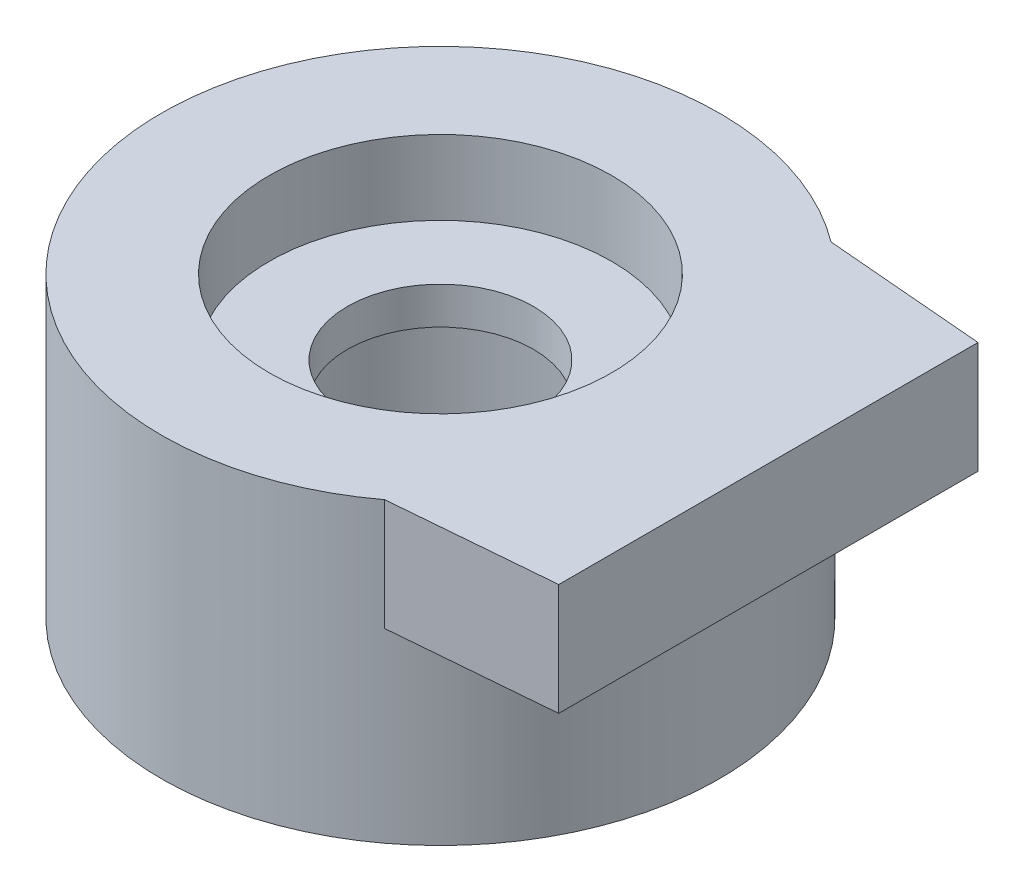
ISO-10303-21;
HEADER;
FILE_DESCRIPTION(('STEP AP214'),'2;1');
FILE_NAME('part.step','',(''),(''),'','','');
FILE_SCHEMA(('AUTOMOTIVE_DESIGN { 1 0 10303 214 1 1 1 1 }'));
ENDSEC;
DATA;
#1=APPLICATION_CONTEXT('core data for automotive mechanical design processes');
#2=APPLICATION_PROTOCOL_DEFINITION('international standard','automotive_design',2000,#1);
#3=PRODUCT_CONTEXT('',#1,'mechanical');
#4=PRODUCT('Part','Part','',(#3));
#5=PRODUCT_RELATED_PRODUCT_CATEGORY('part','',(#4));
#6=PRODUCT_DEFINITION_FORMATION('','',#4);
#7=PRODUCT_DEFINITION_CONTEXT('part definition',#1,'design');
#8=PRODUCT_DEFINITION('design','',#6,#7);
#9=PRODUCT_DEFINITION_SHAPE('','',#8);
#10=(LENGTH_UNIT() NAMED_UNIT(*) SI_UNIT(.MILLI.,.METRE.));
#11=(NAMED_UNIT(*) PLANE_ANGLE_UNIT() SI_UNIT($,.RADIAN.));
#12=(NAMED_UNIT(*) SI_UNIT($,.STERADIAN.) SOLID_ANGLE_UNIT());
#13=UNCERTAINTY_MEASURE_WITH_UNIT(LENGTH_MEASURE(1.E-05),#10,'distance_accuracy_value','');
#14=(GEOMETRIC_REPRESENTATION_CONTEXT(3) GLOBAL_UNCERTAINTY_ASSIGNED_CONTEXT((#13)) GLOBAL_UNIT_ASSIGNED_CONTEXT((#10,
#11,#12)) REPRESENTATION_CONTEXT('',''));
#15=CARTESIAN_POINT('',(0.,0.,0.));
#16=DIRECTION('',(0.,0.,1.));
#17=DIRECTION('',(1.,0.,0.));
#18=AXIS2_PLACEMENT_3D('',#15,#16,#17);
#19=CARTESIAN_POINT('',(0.,2.5,0.));
#20=DIRECTION('',(0.,1.,0.));
#21=DIRECTION('',(0.,0.,1.));
#22=AXIS2_PLACEMENT_3D('',#19,#20,#21);
#23=PLANE('',#22);
#24=CARTESIAN_POINT('',(0.,2.5,0.));
#25=DIRECTION('',(0.,-1.,0.));
#26=DIRECTION('',(0.,0.,-1.));
#27=AXIS2_PLACEMENT_3D('',#24,#25,#26);
#28=CIRCLE('',#27,3.75);
#29=CARTESIAN_POINT('',(2.25,2.5,-3.));
#30=VERTEX_POINT('',#29);
#31=CARTESIAN_POINT('',(2.25,2.5,3.));
#32=VERTEX_POINT('',#31);
#33=EDGE_CURVE('E73',#30,#32,#28,.T.);
#34=ORIENTED_EDGE('',*,*,#33,.F.);
#35=DIRECTION('',(-0.996448898518601,0.,-0.0841997187707064));
#36=VECTOR('',#35,1.);
#37=CARTESIAN_POINT('',(4.40776789419964,2.5,-2.81766907451634));
#38=LINE('',#37,#36);
#39=CARTESIAN_POINT('',(4.40776789419964,2.5,-2.81766907451634));
#40=VERTEX_POINT('',#39);
#41=EDGE_CURVE('E80',#40,#30,#38,.T.);
#42=ORIENTED_EDGE('',*,*,#41,.F.);
#43=DIRECTION('',(0.,0.,-1.));
#44=VECTOR('',#43,1.);
#45=CARTESIAN_POINT('',(4.40776789419964,2.5,2.81766907451634));
#46=LINE('',#45,#44);
#47=CARTESIAN_POINT('',(4.40776789419964,2.5,2.81766907451634));
#48=VERTEX_POINT('',#47);
#49=EDGE_CURVE('E91',#48,#40,#46,.T.);
#50=ORIENTED_EDGE('',*,*,#49,.F.);
#51=DIRECTION('',(0.996448898518601,0.,-0.0841997187707066));
#52=VECTOR('',#51,1.);
#53=CARTESIAN_POINT('',(2.25,2.5,3.));
#54=LINE('',#53,#52);
#55=EDGE_CURVE('E82',#32,#48,#54,.T.);
#56=ORIENTED_EDGE('',*,*,#55,.F.);
#57=EDGE_LOOP('',(#34,#42,#50,#56));
#58=FACE_BOUND('',#57,.T.);
#59=ADVANCED_FACE('F33',(#58),#23,.F.);
#60=CARTESIAN_POINT('',(0.,2.5,0.));
#61=DIRECTION('',(0.,1.,0.));
#62=DIRECTION('',(0.,0.,1.));
#63=AXIS2_PLACEMENT_3D('',#60,#61,#62);
#64=CYLINDRICAL_SURFACE('',#63,3.75);
#65=CARTESIAN_POINT('',(0.,4.,0.));
#66=DIRECTION('',(0.,1.,0.));
#67=DIRECTION('',(0.,0.,1.));
#68=AXIS2_PLACEMENT_3D('',#65,#66,#67);
#69=CIRCLE('',#68,3.75);
#70=CARTESIAN_POINT('',(2.25,4.,-3.));
#71=VERTEX_POINT('',#70);
#72=CARTESIAN_POINT('',(2.25,4.,3.));
#73=VERTEX_POINT('',#72);
#74=EDGE_CURVE('E88',#71,#73,#69,.T.);
#75=ORIENTED_EDGE('',*,*,#74,.F.);
#76=DIRECTION('',(0.,1.,0.));
#77=VECTOR('',#76,1.);
#78=CARTESIAN_POINT('',(2.25,2.5,-3.));
#79=LINE('',#78,#77);
#80=EDGE_CURVE('E11',#30,#71,#79,.T.);
#81=ORIENTED_EDGE('',*,*,#80,.F.);
#82=ORIENTED_EDGE('',*,*,#33,.T.);
#83=DIRECTION('',(0.,1.,0.));
#84=VECTOR('',#83,1.);
#85=CARTESIAN_POINT('',(2.25,2.5,3.));
#86=LINE('',#85,#84);
#87=EDGE_CURVE('E37',#32,#73,#86,.T.);
#88=ORIENTED_EDGE('',*,*,#87,.T.);
#89=EDGE_LOOP('',(#75,#81,#82,#88));
#90=FACE_BOUND('',#89,.T.);
#91=CARTESIAN_POINT('',(0.,0.,0.));
#92=DIRECTION('',(0.,-1.,0.));
#93=DIRECTION('',(0.,0.,-1.));
#94=AXIS2_PLACEMENT_3D('',#91,#92,#93);
#95=CIRCLE('',#94,3.75);
#96=CARTESIAN_POINT('',(0.,0.,-3.75));
#97=VERTEX_POINT('',#96);
#98=EDGE_CURVE('E83',#97,#97,#95,.T.);
#99=ORIENTED_EDGE('',*,*,#98,.F.);
#100=EDGE_LOOP('',(#99));
#101=FACE_BOUND('',#100,.T.);
#102=ADVANCED_FACE('F35',(#90,#101),#64,.T.);
#103=CARTESIAN_POINT('',(4.40776789419964,2.5,-2.81766907451634));
#104=DIRECTION('',(0.0841997187707064,0.,-0.996448898518601));
#105=DIRECTION('',(-0.996448898518601,0.,-0.0841997187707064));
#106=AXIS2_PLACEMENT_3D('',#103,#104,#105);
#107=PLANE('',#106);
#108=DIRECTION('',(-0.996448898518601,0.,-0.0841997187707064));
#109=VECTOR('',#108,1.);
#110=CARTESIAN_POINT('',(4.40776789419964,4.,-2.81766907451634));
#111=LINE('',#110,#109);
#112=CARTESIAN_POINT('',(4.40776789419964,4.,-2.81766907451634));
#113=VERTEX_POINT('',#112);
#114=EDGE_CURVE('E103',#113,#71,#111,.T.);
#115=ORIENTED_EDGE('',*,*,#114,.F.);
#116=DIRECTION('',(0.,1.,0.));
#117=VECTOR('',#116,1.);
#118=CARTESIAN_POINT('',(4.40776789419964,2.5,-2.81766907451634));
#119=LINE('',#118,#117);
#120=EDGE_CURVE('E43',#40,#113,#119,.T.);
#121=ORIENTED_EDGE('',*,*,#120,.F.);
#122=ORIENTED_EDGE('',*,*,#41,.T.);
#123=ORIENTED_EDGE('',*,*,#80,.T.);
#124=EDGE_LOOP('',(#115,#121,#122,#123));
#125=FACE_BOUND('',#124,.T.);
#126=ADVANCED_FACE('F90',(#125),#107,.T.);
#127=CARTESIAN_POINT('',(4.40776789419964,2.5,2.81766907451634));
#128=DIRECTION('',(1.,0.,0.));
#129=DIRECTION('',(0.,0.,-1.));
#130=AXIS2_PLACEMENT_3D('',#127,#128,#129);
#131=PLANE('',#130);
#132=DIRECTION('',(0.,0.,-1.));
#133=VECTOR('',#132,1.);
#134=CARTESIAN_POINT('',(4.40776789419964,4.,2.81766907451634));
#135=LINE('',#134,#133);
#136=CARTESIAN_POINT('',(4.40776789419964,4.,2.81766907451634));
#137=VERTEX_POINT('',#136);
#138=EDGE_CURVE('E101',#137,#113,#135,.T.);
#139=ORIENTED_EDGE('',*,*,#138,.F.);
#140=DIRECTION('',(0.,1.,0.));
#141=VECTOR('',#140,1.);
#142=CARTESIAN_POINT('',(4.40776789419964,2.5,2.81766907451634));
#143=LINE('',#142,#141);
#144=EDGE_CURVE('E93',#48,#137,#143,.T.);
#145=ORIENTED_EDGE('',*,*,#144,.F.);
#146=ORIENTED_EDGE('',*,*,#49,.T.);
#147=ORIENTED_EDGE('',*,*,#120,.T.);
#148=EDGE_LOOP('',(#139,#145,#146,#147));
#149=FACE_BOUND('',#148,.T.);
#150=ADVANCED_FACE('F108',(#149),#131,.T.);
#151=CARTESIAN_POINT('',(2.25,2.5,3.));
#152=DIRECTION('',(0.0841997187707066,0.,0.996448898518601));
#153=DIRECTION('',(0.996448898518601,0.,-0.0841997187707066));
#154=AXIS2_PLACEMENT_3D('',#151,#152,#153);
#155=PLANE('',#154);
#156=DIRECTION('',(0.996448898518601,0.,-0.0841997187707066));
#157=VECTOR('',#156,1.);
#158=CARTESIAN_POINT('',(2.25,4.,3.));
#159=LINE('',#158,#157);
#160=EDGE_CURVE('E98',#73,#137,#159,.T.);
#161=ORIENTED_EDGE('',*,*,#160,.F.);
#162=ORIENTED_EDGE('',*,*,#87,.F.);
#163=ORIENTED_EDGE('',*,*,#55,.T.);
#164=ORIENTED_EDGE('',*,*,#144,.T.);
#165=EDGE_LOOP('',(#161,#162,#163,#164));
#166=FACE_BOUND('',#165,.T.);
#167=ADVANCED_FACE('F107',(#166),#155,.T.);
#168=CARTESIAN_POINT('',(0.,4.,0.));
#169=DIRECTION('',(0.,1.,0.));
#170=DIRECTION('',(0.,0.,1.));
#171=AXIS2_PLACEMENT_3D('',#168,#169,#170);
#172=PLANE('',#171);
#173=CARTESIAN_POINT('',(0.,4.,0.));
#174=DIRECTION('',(0.,1.,0.));
#175=DIRECTION('',(0.,0.,1.));
#176=AXIS2_PLACEMENT_3D('',#173,#174,#175);
#177=CIRCLE('',#176,2.3);
#178=CARTESIAN_POINT('',(0.,4.,2.3));
#179=VERTEX_POINT('',#178);
#180=EDGE_CURVE('E166',#179,#179,#177,.T.);
#181=ORIENTED_EDGE('',*,*,#180,.F.);
#182=EDGE_LOOP('',(#181));
#183=FACE_BOUND('',#182,.T.);
#184=ORIENTED_EDGE('',*,*,#74,.T.);
#185=ORIENTED_EDGE('',*,*,#160,.T.);
#186=ORIENTED_EDGE('',*,*,#138,.T.);
#187=ORIENTED_EDGE('',*,*,#114,.T.);
#188=EDGE_LOOP('',(#184,#185,#186,#187));
#189=FACE_BOUND('',#188,.T.);
#190=ADVANCED_FACE('F110',(#183,#189),#172,.T.);
#191=CARTESIAN_POINT('',(0.,0.,0.));
#192=DIRECTION('',(0.,-1.,0.));
#193=DIRECTION('',(0.,0.,-1.));
#194=AXIS2_PLACEMENT_3D('',#191,#192,#193);
#195=PLANE('',#194);
#196=CARTESIAN_POINT('',(0.,0.,0.));
#197=DIRECTION('',(0.,1.,0.));
#198=DIRECTION('',(0.,0.,1.));
#199=AXIS2_PLACEMENT_3D('',#196,#197,#198);
#200=CIRCLE('',#199,2.3);
#201=CARTESIAN_POINT('',(0.,0.,2.3));
#202=VERTEX_POINT('',#201);
#203=EDGE_CURVE('E84',#202,#202,#200,.T.);
#204=ORIENTED_EDGE('',*,*,#203,.T.);
#205=EDGE_LOOP('',(#204));
#206=FACE_BOUND('',#205,.T.);
#207=ORIENTED_EDGE('',*,*,#98,.T.);
#208=EDGE_LOOP('',(#207));
#209=FACE_BOUND('',#208,.T.);
#210=ADVANCED_FACE('F112',(#206,#209),#195,.T.);
#211=CARTESIAN_POINT('',(0.,0.,0.));
#212=DIRECTION('',(0.,1.,0.));
#213=DIRECTION('',(0.,0.,1.));
#214=AXIS2_PLACEMENT_3D('',#211,#212,#213);
#215=CYLINDRICAL_SURFACE('',#214,2.3);
#216=ORIENTED_EDGE('',*,*,#203,.F.);
#217=EDGE_LOOP('',(#216));
#218=FACE_BOUND('',#217,.T.);
#219=CARTESIAN_POINT('',(0.,2.5,0.));
#220=DIRECTION('',(0.,1.,0.));
#221=DIRECTION('',(0.,0.,1.));
#222=AXIS2_PLACEMENT_3D('',#219,#220,#221);
#223=CIRCLE('',#222,2.3);
#224=CARTESIAN_POINT('',(0.,2.5,2.3));
#225=VERTEX_POINT('',#224);
#226=EDGE_CURVE('E153',#225,#225,#223,.T.);
#227=ORIENTED_EDGE('',*,*,#226,.T.);
#228=EDGE_LOOP('',(#227));
#229=FACE_BOUND('',#228,.T.);
#230=ADVANCED_FACE('F119',(#218,#229),#215,.F.);
#231=CARTESIAN_POINT('',(0.,0.,0.));
#232=DIRECTION('',(0.,1.,0.));
#233=DIRECTION('',(0.,0.,1.));
#234=AXIS2_PLACEMENT_3D('',#231,#232,#233);
#235=CYLINDRICAL_SURFACE('',#234,2.3);
#236=CARTESIAN_POINT('',(0.,3.,0.));
#237=DIRECTION('',(0.,1.,0.));
#238=DIRECTION('',(0.,0.,1.));
#239=AXIS2_PLACEMENT_3D('',#236,#237,#238);
#240=CIRCLE('',#239,2.3);
#241=CARTESIAN_POINT('',(0.,3.,2.3));
#242=VERTEX_POINT('',#241);
#243=EDGE_CURVE('E160',#242,#242,#240,.T.);
#244=ORIENTED_EDGE('',*,*,#243,.F.);
#245=EDGE_LOOP('',(#244));
#246=FACE_BOUND('',#245,.T.);
#247=ORIENTED_EDGE('',*,*,#180,.T.);
#248=EDGE_LOOP('',(#247));
#249=FACE_BOUND('',#248,.T.);
#250=ADVANCED_FACE('F132',(#246,#249),#235,.F.);
#251=CARTESIAN_POINT('',(2.3,3.,0.));
#252=DIRECTION('',(0.,-1.,0.));
#253=DIRECTION('',(0.,0.,-1.));
#254=AXIS2_PLACEMENT_3D('',#251,#252,#253);
#255=PLANE('',#254);
#256=CARTESIAN_POINT('',(0.,3.,0.));
#257=DIRECTION('',(0.,1.,0.));
#258=DIRECTION('',(0.,0.,1.));
#259=AXIS2_PLACEMENT_3D('',#256,#257,#258);
#260=CIRCLE('',#259,1.25);
#261=CARTESIAN_POINT('',(0.,3.,1.25));
#262=VERTEX_POINT('',#261);
#263=EDGE_CURVE('E157',#262,#262,#260,.T.);
#264=ORIENTED_EDGE('',*,*,#263,.F.);
#265=EDGE_LOOP('',(#264));
#266=FACE_BOUND('',#265,.T.);
#267=ORIENTED_EDGE('',*,*,#243,.T.);
#268=EDGE_LOOP('',(#267));
#269=FACE_BOUND('',#268,.T.);
#270=ADVANCED_FACE('F136',(#266,#269),#255,.F.);
#271=CARTESIAN_POINT('',(0.,0.,0.));
#272=DIRECTION('',(0.,1.,0.));
#273=DIRECTION('',(0.,0.,1.));
#274=AXIS2_PLACEMENT_3D('',#271,#272,#273);
#275=CYLINDRICAL_SURFACE('',#274,1.25);
#276=CARTESIAN_POINT('',(0.,2.5,0.));
#277=DIRECTION('',(0.,1.,0.));
#278=DIRECTION('',(0.,0.,1.));
#279=AXIS2_PLACEMENT_3D('',#276,#277,#278);
#280=CIRCLE('',#279,1.25);
#281=CARTESIAN_POINT('',(0.,2.5,1.25));
#282=VERTEX_POINT('',#281);
#283=EDGE_CURVE('E156',#282,#282,#280,.T.);
#284=ORIENTED_EDGE('',*,*,#283,.F.);
#285=EDGE_LOOP('',(#284));
#286=FACE_BOUND('',#285,.T.);
#287=ORIENTED_EDGE('',*,*,#263,.T.);
#288=EDGE_LOOP('',(#287));
#289=FACE_BOUND('',#288,.T.);
#290=ADVANCED_FACE('F140',(#286,#289),#275,.F.);
#291=CARTESIAN_POINT('',(1.25,2.5,0.));
#292=DIRECTION('',(0.,1.,0.));
#293=DIRECTION('',(0.,0.,1.));
#294=AXIS2_PLACEMENT_3D('',#291,#292,#293);
#295=PLANE('',#294);
#296=ORIENTED_EDGE('',*,*,#226,.F.);
#297=EDGE_LOOP('',(#296));
#298=FACE_BOUND('',#297,.T.);
#299=ORIENTED_EDGE('',*,*,#283,.T.);
#300=EDGE_LOOP('',(#299));
#301=FACE_BOUND('',#300,.T.);
#302=ADVANCED_FACE('F144',(#298,#301),#295,.F.);
#303=CLOSED_SHELL('',(#59,#102,#126,#150,#167,#190,#210,#230,#250,#270,#290,#302));
#304=MANIFOLD_SOLID_BREP('B2',#303);
#305=ADVANCED_BREP_SHAPE_REPRESENTATION('',(#18,#304),#14);
#306=SHAPE_DEFINITION_REPRESENTATION(#9,#305);
ENDSEC;
END-ISO-10303-21;
